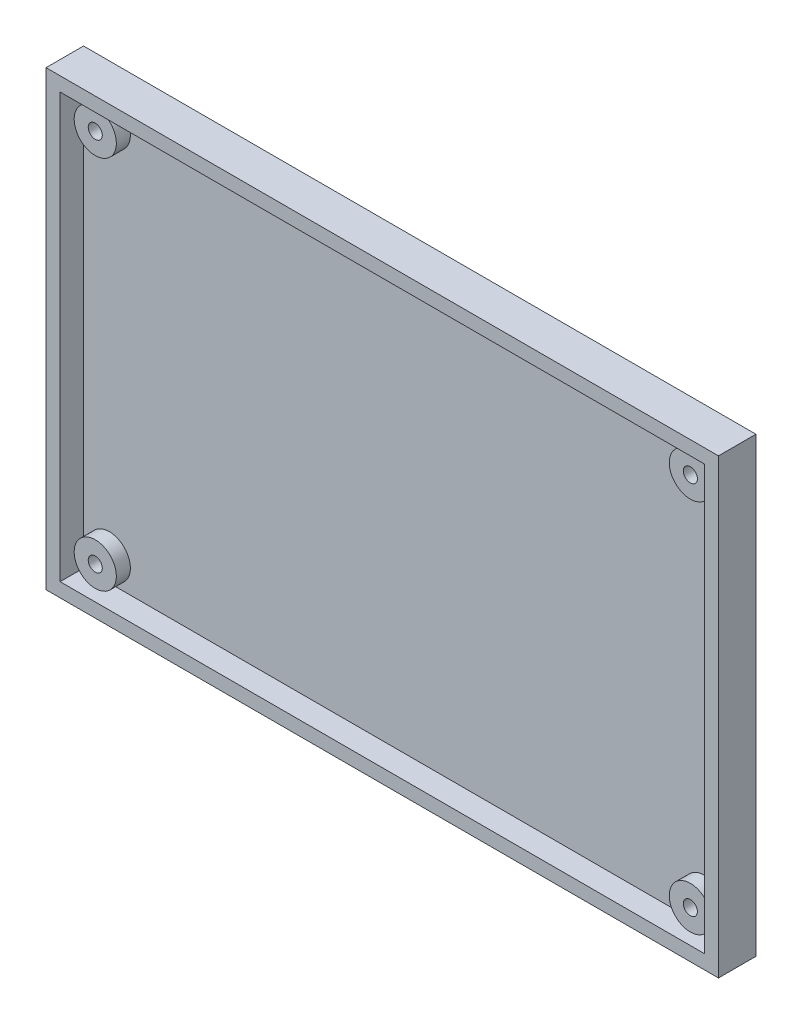
ISO-10303-21;
HEADER;
FILE_DESCRIPTION(('STEP AP214'),'2;1');
FILE_NAME('part.step','',(''),(''),'','','');
FILE_SCHEMA(('AUTOMOTIVE_DESIGN { 1 0 10303 214 1 1 1 1 }'));
ENDSEC;
DATA;
#1=APPLICATION_CONTEXT('core data for automotive mechanical design processes');
#2=APPLICATION_PROTOCOL_DEFINITION('international standard','automotive_design',2000,#1);
#3=PRODUCT_CONTEXT('',#1,'mechanical');
#4=PRODUCT('Part','Part','',(#3));
#5=PRODUCT_RELATED_PRODUCT_CATEGORY('part','',(#4));
#6=PRODUCT_DEFINITION_FORMATION('','',#4);
#7=PRODUCT_DEFINITION_CONTEXT('part definition',#1,'design');
#8=PRODUCT_DEFINITION('design','',#6,#7);
#9=PRODUCT_DEFINITION_SHAPE('','',#8);
#10=(LENGTH_UNIT() NAMED_UNIT(*) SI_UNIT(.MILLI.,.METRE.));
#11=(NAMED_UNIT(*) PLANE_ANGLE_UNIT() SI_UNIT($,.RADIAN.));
#12=(NAMED_UNIT(*) SI_UNIT($,.STERADIAN.) SOLID_ANGLE_UNIT());
#13=UNCERTAINTY_MEASURE_WITH_UNIT(LENGTH_MEASURE(1.E-05),#10,'distance_accuracy_value','');
#14=(GEOMETRIC_REPRESENTATION_CONTEXT(3) GLOBAL_UNCERTAINTY_ASSIGNED_CONTEXT((#13)) GLOBAL_UNIT_ASSIGNED_CONTEXT((#10,
#11,#12)) REPRESENTATION_CONTEXT('',''));
#15=CARTESIAN_POINT('',(0.,0.,0.));
#16=DIRECTION('',(0.,0.,1.));
#17=DIRECTION('',(1.,0.,0.));
#18=AXIS2_PLACEMENT_3D('',#15,#16,#17);
#19=CARTESIAN_POINT('',(0.,0.,8.));
#20=DIRECTION('',(0.,0.,-1.));
#21=DIRECTION('',(-1.,0.,0.));
#22=AXIS2_PLACEMENT_3D('',#19,#20,#21);
#23=PLANE('',#22);
#24=DIRECTION('',(0.,-1.,0.));
#25=VECTOR('',#24,1.);
#26=CARTESIAN_POINT('',(3.,0.,8.));
#27=LINE('',#26,#25);
#28=CARTESIAN_POINT('',(3.,93.5,8.));
#29=VERTEX_POINT('',#28);
#30=CARTESIAN_POINT('',(3.,3.,8.));
#31=VERTEX_POINT('',#30);
#32=EDGE_CURVE('E133',#29,#31,#27,.T.);
#33=ORIENTED_EDGE('',*,*,#32,.F.);
#34=DIRECTION('',(-1.,0.,0.));
#35=VECTOR('',#34,1.);
#36=CARTESIAN_POINT('',(0.,93.5,8.));
#37=LINE('',#36,#35);
#38=CARTESIAN_POINT('',(140.5,93.5,8.));
#39=VERTEX_POINT('',#38);
#40=EDGE_CURVE('E119',#39,#29,#37,.T.);
#41=ORIENTED_EDGE('',*,*,#40,.F.);
#42=DIRECTION('',(0.,1.,0.));
#43=VECTOR('',#42,1.);
#44=CARTESIAN_POINT('',(140.5,0.,8.));
#45=LINE('',#44,#43);
#46=CARTESIAN_POINT('',(140.5,3.,8.));
#47=VERTEX_POINT('',#46);
#48=EDGE_CURVE('E164',#47,#39,#45,.T.);
#49=ORIENTED_EDGE('',*,*,#48,.F.);
#50=DIRECTION('',(1.,0.,0.));
#51=VECTOR('',#50,1.);
#52=CARTESIAN_POINT('',(0.,3.,8.));
#53=LINE('',#52,#51);
#54=EDGE_CURVE('E162',#31,#47,#53,.T.);
#55=ORIENTED_EDGE('',*,*,#54,.F.);
#56=EDGE_LOOP('',(#33,#41,#49,#55));
#57=FACE_BOUND('',#56,.T.);
#58=DIRECTION('',(0.,-1.,0.));
#59=VECTOR('',#58,1.);
#60=CARTESIAN_POINT('',(0.,0.,8.));
#61=LINE('',#60,#59);
#62=CARTESIAN_POINT('',(0.,96.5,8.));
#63=VERTEX_POINT('',#62);
#64=CARTESIAN_POINT('',(0.,0.,8.));
#65=VERTEX_POINT('',#64);
#66=EDGE_CURVE('E179',#63,#65,#61,.T.);
#67=ORIENTED_EDGE('',*,*,#66,.T.);
#68=DIRECTION('',(1.,0.,0.));
#69=VECTOR('',#68,1.);
#70=CARTESIAN_POINT('',(0.,0.,8.));
#71=LINE('',#70,#69);
#72=CARTESIAN_POINT('',(143.5,0.,8.));
#73=VERTEX_POINT('',#72);
#74=EDGE_CURVE('E94',#65,#73,#71,.T.);
#75=ORIENTED_EDGE('',*,*,#74,.T.);
#76=DIRECTION('',(0.,1.,0.));
#77=VECTOR('',#76,1.);
#78=CARTESIAN_POINT('',(143.5,0.,8.));
#79=LINE('',#78,#77);
#80=CARTESIAN_POINT('',(143.5,96.5,8.));
#81=VERTEX_POINT('',#80);
#82=EDGE_CURVE('E182',#73,#81,#79,.T.);
#83=ORIENTED_EDGE('',*,*,#82,.T.);
#84=DIRECTION('',(-1.,0.,0.));
#85=VECTOR('',#84,1.);
#86=CARTESIAN_POINT('',(0.,96.5,8.));
#87=LINE('',#86,#85);
#88=EDGE_CURVE('E66',#81,#63,#87,.T.);
#89=ORIENTED_EDGE('',*,*,#88,.T.);
#90=EDGE_LOOP('',(#67,#75,#83,#89));
#91=FACE_BOUND('',#90,.T.);
#92=ADVANCED_FACE('F41',(#57,#91),#23,.F.);
#93=CARTESIAN_POINT('',(0.,0.,0.));
#94=DIRECTION('',(0.,0.,-1.));
#95=DIRECTION('',(-1.,0.,0.));
#96=AXIS2_PLACEMENT_3D('',#93,#94,#95);
#97=PLANE('',#96);
#98=CARTESIAN_POINT('',(135.5,8.,0.));
#99=DIRECTION('',(0.,0.,1.));
#100=DIRECTION('',(1.,0.,0.));
#101=AXIS2_PLACEMENT_3D('',#98,#99,#100);
#102=CIRCLE('',#101,1.5);
#103=CARTESIAN_POINT('',(137.,8.,0.));
#104=VERTEX_POINT('',#103);
#105=EDGE_CURVE('E169',#104,#104,#102,.T.);
#106=ORIENTED_EDGE('',*,*,#105,.T.);
#107=EDGE_LOOP('',(#106));
#108=FACE_BOUND('',#107,.T.);
#109=CARTESIAN_POINT('',(8.5,88.,0.));
#110=DIRECTION('',(0.,0.,1.));
#111=DIRECTION('',(1.,0.,0.));
#112=AXIS2_PLACEMENT_3D('',#109,#110,#111);
#113=CIRCLE('',#112,1.5);
#114=CARTESIAN_POINT('',(10.,88.,0.));
#115=VERTEX_POINT('',#114);
#116=EDGE_CURVE('E175',#115,#115,#113,.T.);
#117=ORIENTED_EDGE('',*,*,#116,.T.);
#118=EDGE_LOOP('',(#117));
#119=FACE_BOUND('',#118,.T.);
#120=DIRECTION('',(0.,-1.,0.));
#121=VECTOR('',#120,1.);
#122=CARTESIAN_POINT('',(0.,0.,0.));
#123=LINE('',#122,#121);
#124=CARTESIAN_POINT('',(0.,96.5,0.));
#125=VERTEX_POINT('',#124);
#126=CARTESIAN_POINT('',(0.,0.,0.));
#127=VERTEX_POINT('',#126);
#128=EDGE_CURVE('E178',#125,#127,#123,.T.);
#129=ORIENTED_EDGE('',*,*,#128,.F.);
#130=DIRECTION('',(-1.,0.,0.));
#131=VECTOR('',#130,1.);
#132=CARTESIAN_POINT('',(0.,96.5,0.));
#133=LINE('',#132,#131);
#134=CARTESIAN_POINT('',(143.5,96.5,0.));
#135=VERTEX_POINT('',#134);
#136=EDGE_CURVE('E87',#135,#125,#133,.T.);
#137=ORIENTED_EDGE('',*,*,#136,.F.);
#138=DIRECTION('',(0.,1.,0.));
#139=VECTOR('',#138,1.);
#140=CARTESIAN_POINT('',(143.5,0.,0.));
#141=LINE('',#140,#139);
#142=CARTESIAN_POINT('',(143.5,0.,0.));
#143=VERTEX_POINT('',#142);
#144=EDGE_CURVE('E190',#143,#135,#141,.T.);
#145=ORIENTED_EDGE('',*,*,#144,.F.);
#146=DIRECTION('',(1.,0.,0.));
#147=VECTOR('',#146,1.);
#148=CARTESIAN_POINT('',(0.,0.,0.));
#149=LINE('',#148,#147);
#150=EDGE_CURVE('E188',#127,#143,#149,.T.);
#151=ORIENTED_EDGE('',*,*,#150,.F.);
#152=EDGE_LOOP('',(#129,#137,#145,#151));
#153=FACE_BOUND('',#152,.T.);
#154=CARTESIAN_POINT('',(8.50000000000001,8.,0.));
#155=DIRECTION('',(0.,0.,1.));
#156=DIRECTION('',(1.,0.,0.));
#157=AXIS2_PLACEMENT_3D('',#154,#155,#156);
#158=CIRCLE('',#157,1.5);
#159=CARTESIAN_POINT('',(10.,8.,0.));
#160=VERTEX_POINT('',#159);
#161=EDGE_CURVE('E172',#160,#160,#158,.T.);
#162=ORIENTED_EDGE('',*,*,#161,.T.);
#163=EDGE_LOOP('',(#162));
#164=FACE_BOUND('',#163,.T.);
#165=CARTESIAN_POINT('',(135.5,88.,0.));
#166=DIRECTION('',(0.,0.,1.));
#167=DIRECTION('',(1.,0.,0.));
#168=AXIS2_PLACEMENT_3D('',#165,#166,#167);
#169=CIRCLE('',#168,1.5);
#170=CARTESIAN_POINT('',(137.,88.,0.));
#171=VERTEX_POINT('',#170);
#172=EDGE_CURVE('E156',#171,#171,#169,.T.);
#173=ORIENTED_EDGE('',*,*,#172,.T.);
#174=EDGE_LOOP('',(#173));
#175=FACE_BOUND('',#174,.T.);
#176=ADVANCED_FACE('F204',(#108,#119,#153,#164,#175),#97,.T.);
#177=CARTESIAN_POINT('',(0.,0.,8.));
#178=DIRECTION('',(1.,0.,0.));
#179=DIRECTION('',(0.,0.,-1.));
#180=AXIS2_PLACEMENT_3D('',#177,#178,#179);
#181=PLANE('',#180);
#182=ORIENTED_EDGE('',*,*,#128,.T.);
#183=DIRECTION('',(0.,0.,-1.));
#184=VECTOR('',#183,1.);
#185=CARTESIAN_POINT('',(0.,0.,8.));
#186=LINE('',#185,#184);
#187=EDGE_CURVE('E11',#65,#127,#186,.T.);
#188=ORIENTED_EDGE('',*,*,#187,.F.);
#189=ORIENTED_EDGE('',*,*,#66,.F.);
#190=DIRECTION('',(0.,0.,-1.));
#191=VECTOR('',#190,1.);
#192=CARTESIAN_POINT('',(0.,96.5,8.));
#193=LINE('',#192,#191);
#194=EDGE_CURVE('E185',#63,#125,#193,.T.);
#195=ORIENTED_EDGE('',*,*,#194,.T.);
#196=EDGE_LOOP('',(#182,#188,#189,#195));
#197=FACE_BOUND('',#196,.T.);
#198=ADVANCED_FACE('F43',(#197),#181,.F.);
#199=CARTESIAN_POINT('',(0.,0.,8.));
#200=DIRECTION('',(0.,1.,0.));
#201=DIRECTION('',(0.,0.,1.));
#202=AXIS2_PLACEMENT_3D('',#199,#200,#201);
#203=PLANE('',#202);
#204=ORIENTED_EDGE('',*,*,#150,.T.);
#205=DIRECTION('',(0.,0.,-1.));
#206=VECTOR('',#205,1.);
#207=CARTESIAN_POINT('',(143.5,0.,8.));
#208=LINE('',#207,#206);
#209=EDGE_CURVE('E50',#73,#143,#208,.T.);
#210=ORIENTED_EDGE('',*,*,#209,.F.);
#211=ORIENTED_EDGE('',*,*,#74,.F.);
#212=ORIENTED_EDGE('',*,*,#187,.T.);
#213=EDGE_LOOP('',(#204,#210,#211,#212));
#214=FACE_BOUND('',#213,.T.);
#215=ADVANCED_FACE('F221',(#214),#203,.F.);
#216=CARTESIAN_POINT('',(143.5,0.,8.));
#217=DIRECTION('',(-1.,0.,0.));
#218=DIRECTION('',(0.,0.,1.));
#219=AXIS2_PLACEMENT_3D('',#216,#217,#218);
#220=PLANE('',#219);
#221=ORIENTED_EDGE('',*,*,#144,.T.);
#222=DIRECTION('',(0.,0.,-1.));
#223=VECTOR('',#222,1.);
#224=CARTESIAN_POINT('',(143.5,96.5,8.));
#225=LINE('',#224,#223);
#226=EDGE_CURVE('E194',#81,#135,#225,.T.);
#227=ORIENTED_EDGE('',*,*,#226,.F.);
#228=ORIENTED_EDGE('',*,*,#82,.F.);
#229=ORIENTED_EDGE('',*,*,#209,.T.);
#230=EDGE_LOOP('',(#221,#227,#228,#229));
#231=FACE_BOUND('',#230,.T.);
#232=ADVANCED_FACE('F200',(#231),#220,.F.);
#233=CARTESIAN_POINT('',(0.,96.5,8.));
#234=DIRECTION('',(0.,-1.,0.));
#235=DIRECTION('',(0.,0.,-1.));
#236=AXIS2_PLACEMENT_3D('',#233,#234,#235);
#237=PLANE('',#236);
#238=ORIENTED_EDGE('',*,*,#136,.T.);
#239=ORIENTED_EDGE('',*,*,#194,.F.);
#240=ORIENTED_EDGE('',*,*,#88,.F.);
#241=ORIENTED_EDGE('',*,*,#226,.T.);
#242=EDGE_LOOP('',(#238,#239,#240,#241));
#243=FACE_BOUND('',#242,.T.);
#244=ADVANCED_FACE('F209',(#243),#237,.F.);
#245=CARTESIAN_POINT('',(8.5,88.,8.));
#246=DIRECTION('',(0.,0.,-1.));
#247=DIRECTION('',(-1.,0.,0.));
#248=AXIS2_PLACEMENT_3D('',#245,#246,#247);
#249=CYLINDRICAL_SURFACE('',#248,1.5);
#250=CARTESIAN_POINT('',(8.5,88.,6.));
#251=DIRECTION('',(0.,0.,-1.));
#252=DIRECTION('',(-1.,0.,0.));
#253=AXIS2_PLACEMENT_3D('',#250,#251,#252);
#254=CIRCLE('',#253,1.5);
#255=CARTESIAN_POINT('',(7.,88.,6.));
#256=VERTEX_POINT('',#255);
#257=EDGE_CURVE('E155',#256,#256,#254,.T.);
#258=ORIENTED_EDGE('',*,*,#257,.F.);
#259=EDGE_LOOP('',(#258));
#260=FACE_BOUND('',#259,.T.);
#261=ORIENTED_EDGE('',*,*,#116,.F.);
#262=EDGE_LOOP('',(#261));
#263=FACE_BOUND('',#262,.T.);
#264=ADVANCED_FACE('F211',(#260,#263),#249,.F.);
#265=CARTESIAN_POINT('',(8.50000000000001,8.,8.));
#266=DIRECTION('',(0.,0.,-1.));
#267=DIRECTION('',(-1.,0.,0.));
#268=AXIS2_PLACEMENT_3D('',#265,#266,#267);
#269=CYLINDRICAL_SURFACE('',#268,1.5);
#270=CARTESIAN_POINT('',(8.50000000000001,8.,6.));
#271=DIRECTION('',(0.,0.,-1.));
#272=DIRECTION('',(-1.,0.,0.));
#273=AXIS2_PLACEMENT_3D('',#270,#271,#272);
#274=CIRCLE('',#273,1.5);
#275=CARTESIAN_POINT('',(7.00000000000001,8.,6.));
#276=VERTEX_POINT('',#275);
#277=EDGE_CURVE('E312',#276,#276,#274,.T.);
#278=ORIENTED_EDGE('',*,*,#277,.F.);
#279=EDGE_LOOP('',(#278));
#280=FACE_BOUND('',#279,.T.);
#281=ORIENTED_EDGE('',*,*,#161,.F.);
#282=EDGE_LOOP('',(#281));
#283=FACE_BOUND('',#282,.T.);
#284=ADVANCED_FACE('F218',(#280,#283),#269,.F.);
#285=CARTESIAN_POINT('',(135.5,8.,8.));
#286=DIRECTION('',(0.,0.,-1.));
#287=DIRECTION('',(-1.,0.,0.));
#288=AXIS2_PLACEMENT_3D('',#285,#286,#287);
#289=CYLINDRICAL_SURFACE('',#288,1.5);
#290=CARTESIAN_POINT('',(135.5,8.,6.));
#291=DIRECTION('',(0.,0.,-1.));
#292=DIRECTION('',(-1.,0.,0.));
#293=AXIS2_PLACEMENT_3D('',#290,#291,#292);
#294=CIRCLE('',#293,1.5);
#295=CARTESIAN_POINT('',(134.,8.,6.));
#296=VERTEX_POINT('',#295);
#297=EDGE_CURVE('E309',#296,#296,#294,.T.);
#298=ORIENTED_EDGE('',*,*,#297,.F.);
#299=EDGE_LOOP('',(#298));
#300=FACE_BOUND('',#299,.T.);
#301=ORIENTED_EDGE('',*,*,#105,.F.);
#302=EDGE_LOOP('',(#301));
#303=FACE_BOUND('',#302,.T.);
#304=ADVANCED_FACE('F234',(#300,#303),#289,.F.);
#305=CARTESIAN_POINT('',(135.5,88.,8.));
#306=DIRECTION('',(0.,0.,-1.));
#307=DIRECTION('',(-1.,0.,0.));
#308=AXIS2_PLACEMENT_3D('',#305,#306,#307);
#309=CYLINDRICAL_SURFACE('',#308,1.5);
#310=CARTESIAN_POINT('',(135.5,88.,6.));
#311=DIRECTION('',(0.,0.,-1.));
#312=DIRECTION('',(-1.,0.,0.));
#313=AXIS2_PLACEMENT_3D('',#310,#311,#312);
#314=CIRCLE('',#313,1.5);
#315=CARTESIAN_POINT('',(134.,88.,6.));
#316=VERTEX_POINT('',#315);
#317=EDGE_CURVE('E294',#316,#316,#314,.T.);
#318=ORIENTED_EDGE('',*,*,#317,.F.);
#319=EDGE_LOOP('',(#318));
#320=FACE_BOUND('',#319,.T.);
#321=ORIENTED_EDGE('',*,*,#172,.F.);
#322=EDGE_LOOP('',(#321));
#323=FACE_BOUND('',#322,.T.);
#324=ADVANCED_FACE('F238',(#320,#323),#309,.F.);
#325=CARTESIAN_POINT('',(0.,0.,3.));
#326=DIRECTION('',(0.,0.,-1.));
#327=DIRECTION('',(-1.,0.,0.));
#328=AXIS2_PLACEMENT_3D('',#325,#326,#327);
#329=PLANE('',#328);
#330=CARTESIAN_POINT('',(135.5,8.,3.));
#331=DIRECTION('',(0.,0.,-1.));
#332=DIRECTION('',(-1.,0.,0.));
#333=AXIS2_PLACEMENT_3D('',#330,#331,#332);
#334=CIRCLE('',#333,4.5);
#335=CARTESIAN_POINT('',(131.,8.,3.));
#336=VERTEX_POINT('',#335);
#337=EDGE_CURVE('E151',#336,#336,#334,.F.);
#338=ORIENTED_EDGE('',*,*,#337,.F.);
#339=EDGE_LOOP('',(#338));
#340=FACE_BOUND('',#339,.T.);
#341=CARTESIAN_POINT('',(8.5,88.,3.));
#342=DIRECTION('',(0.,0.,-1.));
#343=DIRECTION('',(-1.,0.,0.));
#344=AXIS2_PLACEMENT_3D('',#341,#342,#343);
#345=CIRCLE('',#344,4.5);
#346=CARTESIAN_POINT('',(4.,88.,3.));
#347=VERTEX_POINT('',#346);
#348=EDGE_CURVE('E140',#347,#347,#345,.F.);
#349=ORIENTED_EDGE('',*,*,#348,.F.);
#350=EDGE_LOOP('',(#349));
#351=FACE_BOUND('',#350,.T.);
#352=DIRECTION('',(0.,-1.,0.));
#353=VECTOR('',#352,1.);
#354=CARTESIAN_POINT('',(3.,0.,3.));
#355=LINE('',#354,#353);
#356=CARTESIAN_POINT('',(3.,93.5,3.));
#357=VERTEX_POINT('',#356);
#358=CARTESIAN_POINT('',(3.,3.,3.));
#359=VERTEX_POINT('',#358);
#360=EDGE_CURVE('E130',#357,#359,#355,.T.);
#361=ORIENTED_EDGE('',*,*,#360,.T.);
#362=DIRECTION('',(1.,0.,0.));
#363=VECTOR('',#362,1.);
#364=CARTESIAN_POINT('',(0.,3.,3.));
#365=LINE('',#364,#363);
#366=CARTESIAN_POINT('',(140.5,3.,3.));
#367=VERTEX_POINT('',#366);
#368=EDGE_CURVE('E139',#359,#367,#365,.T.);
#369=ORIENTED_EDGE('',*,*,#368,.T.);
#370=DIRECTION('',(0.,1.,0.));
#371=VECTOR('',#370,1.);
#372=CARTESIAN_POINT('',(140.5,0.,3.));
#373=LINE('',#372,#371);
#374=CARTESIAN_POINT('',(140.5,93.5,3.));
#375=VERTEX_POINT('',#374);
#376=EDGE_CURVE('E132',#367,#375,#373,.T.);
#377=ORIENTED_EDGE('',*,*,#376,.T.);
#378=DIRECTION('',(-1.,0.,0.));
#379=VECTOR('',#378,1.);
#380=CARTESIAN_POINT('',(0.,93.5,3.));
#381=LINE('',#380,#379);
#382=EDGE_CURVE('E117',#375,#357,#381,.T.);
#383=ORIENTED_EDGE('',*,*,#382,.T.);
#384=EDGE_LOOP('',(#361,#369,#377,#383));
#385=FACE_BOUND('',#384,.T.);
#386=CARTESIAN_POINT('',(8.50000000000001,8.,3.));
#387=DIRECTION('',(0.,0.,-1.));
#388=DIRECTION('',(-1.,0.,0.));
#389=AXIS2_PLACEMENT_3D('',#386,#387,#388);
#390=CIRCLE('',#389,4.5);
#391=CARTESIAN_POINT('',(4.00000000000001,8.,3.));
#392=VERTEX_POINT('',#391);
#393=EDGE_CURVE('E144',#392,#392,#390,.F.);
#394=ORIENTED_EDGE('',*,*,#393,.F.);
#395=EDGE_LOOP('',(#394));
#396=FACE_BOUND('',#395,.T.);
#397=CARTESIAN_POINT('',(135.5,88.,3.));
#398=DIRECTION('',(0.,0.,-1.));
#399=DIRECTION('',(-1.,0.,0.));
#400=AXIS2_PLACEMENT_3D('',#397,#398,#399);
#401=CIRCLE('',#400,4.5);
#402=CARTESIAN_POINT('',(131.,88.,3.));
#403=VERTEX_POINT('',#402);
#404=EDGE_CURVE('E152',#403,#403,#401,.F.);
#405=ORIENTED_EDGE('',*,*,#404,.F.);
#406=EDGE_LOOP('',(#405));
#407=FACE_BOUND('',#406,.T.);
#408=ADVANCED_FACE('F127',(#340,#351,#385,#396,#407),#329,.F.);
#409=CARTESIAN_POINT('',(3.,0.,8.));
#410=DIRECTION('',(1.,0.,0.));
#411=DIRECTION('',(0.,0.,-1.));
#412=AXIS2_PLACEMENT_3D('',#409,#410,#411);
#413=PLANE('',#412);
#414=ORIENTED_EDGE('',*,*,#360,.F.);
#415=DIRECTION('',(0.,0.,-1.));
#416=VECTOR('',#415,1.);
#417=CARTESIAN_POINT('',(3.,93.5,8.));
#418=LINE('',#417,#416);
#419=EDGE_CURVE('E114',#29,#357,#418,.T.);
#420=ORIENTED_EDGE('',*,*,#419,.F.);
#421=ORIENTED_EDGE('',*,*,#32,.T.);
#422=DIRECTION('',(0.,0.,-1.));
#423=VECTOR('',#422,1.);
#424=CARTESIAN_POINT('',(3.,3.,8.));
#425=LINE('',#424,#423);
#426=EDGE_CURVE('E137',#31,#359,#425,.T.);
#427=ORIENTED_EDGE('',*,*,#426,.T.);
#428=EDGE_LOOP('',(#414,#420,#421,#427));
#429=FACE_BOUND('',#428,.T.);
#430=ADVANCED_FACE('F135',(#429),#413,.T.);
#431=CARTESIAN_POINT('',(0.,3.,8.));
#432=DIRECTION('',(0.,1.,0.));
#433=DIRECTION('',(0.,0.,1.));
#434=AXIS2_PLACEMENT_3D('',#431,#432,#433);
#435=PLANE('',#434);
#436=ORIENTED_EDGE('',*,*,#368,.F.);
#437=ORIENTED_EDGE('',*,*,#426,.F.);
#438=ORIENTED_EDGE('',*,*,#54,.T.);
#439=DIRECTION('',(0.,0.,-1.));
#440=VECTOR('',#439,1.);
#441=CARTESIAN_POINT('',(140.5,3.,8.));
#442=LINE('',#441,#440);
#443=EDGE_CURVE('E157',#47,#367,#442,.T.);
#444=ORIENTED_EDGE('',*,*,#443,.T.);
#445=EDGE_LOOP('',(#436,#437,#438,#444));
#446=FACE_BOUND('',#445,.T.);
#447=ADVANCED_FACE('F265',(#446),#435,.T.);
#448=CARTESIAN_POINT('',(140.5,0.,8.));
#449=DIRECTION('',(-1.,0.,0.));
#450=DIRECTION('',(0.,0.,1.));
#451=AXIS2_PLACEMENT_3D('',#448,#449,#450);
#452=PLANE('',#451);
#453=ORIENTED_EDGE('',*,*,#376,.F.);
#454=ORIENTED_EDGE('',*,*,#443,.F.);
#455=ORIENTED_EDGE('',*,*,#48,.T.);
#456=DIRECTION('',(0.,0.,-1.));
#457=VECTOR('',#456,1.);
#458=CARTESIAN_POINT('',(140.5,93.5,8.));
#459=LINE('',#458,#457);
#460=EDGE_CURVE('E57',#39,#375,#459,.T.);
#461=ORIENTED_EDGE('',*,*,#460,.T.);
#462=EDGE_LOOP('',(#453,#454,#455,#461));
#463=FACE_BOUND('',#462,.T.);
#464=ADVANCED_FACE('F262',(#463),#452,.T.);
#465=CARTESIAN_POINT('',(0.,93.5,8.));
#466=DIRECTION('',(0.,-1.,0.));
#467=DIRECTION('',(0.,0.,-1.));
#468=AXIS2_PLACEMENT_3D('',#465,#466,#467);
#469=PLANE('',#468);
#470=ORIENTED_EDGE('',*,*,#382,.F.);
#471=ORIENTED_EDGE('',*,*,#460,.F.);
#472=ORIENTED_EDGE('',*,*,#40,.T.);
#473=ORIENTED_EDGE('',*,*,#419,.T.);
#474=EDGE_LOOP('',(#470,#471,#472,#473));
#475=FACE_BOUND('',#474,.T.);
#476=ADVANCED_FACE('F116',(#475),#469,.T.);
#477=CARTESIAN_POINT('',(8.5,88.,8.));
#478=DIRECTION('',(0.,0.,-1.));
#479=DIRECTION('',(-1.,0.,0.));
#480=AXIS2_PLACEMENT_3D('',#477,#478,#479);
#481=CYLINDRICAL_SURFACE('',#480,4.5);
#482=CARTESIAN_POINT('',(8.5,88.,6.));
#483=DIRECTION('',(0.,0.,-1.));
#484=DIRECTION('',(-1.,0.,0.));
#485=AXIS2_PLACEMENT_3D('',#482,#483,#484);
#486=CIRCLE('',#485,4.5);
#487=CARTESIAN_POINT('',(4.,88.,6.));
#488=VERTEX_POINT('',#487);
#489=EDGE_CURVE('E303',#488,#488,#486,.T.);
#490=ORIENTED_EDGE('',*,*,#489,.T.);
#491=EDGE_LOOP('',(#490));
#492=FACE_BOUND('',#491,.T.);
#493=ORIENTED_EDGE('',*,*,#348,.T.);
#494=EDGE_LOOP('',(#493));
#495=FACE_BOUND('',#494,.T.);
#496=ADVANCED_FACE('F255',(#492,#495),#481,.T.);
#497=CARTESIAN_POINT('',(8.50000000000001,8.,8.));
#498=DIRECTION('',(0.,0.,-1.));
#499=DIRECTION('',(-1.,0.,0.));
#500=AXIS2_PLACEMENT_3D('',#497,#498,#499);
#501=CYLINDRICAL_SURFACE('',#500,4.5);
#502=CARTESIAN_POINT('',(8.50000000000001,8.,6.));
#503=DIRECTION('',(0.,0.,-1.));
#504=DIRECTION('',(-1.,0.,0.));
#505=AXIS2_PLACEMENT_3D('',#502,#503,#504);
#506=CIRCLE('',#505,4.5);
#507=CARTESIAN_POINT('',(4.00000000000001,8.,6.));
#508=VERTEX_POINT('',#507);
#509=EDGE_CURVE('E299',#508,#508,#506,.T.);
#510=ORIENTED_EDGE('',*,*,#509,.T.);
#511=EDGE_LOOP('',(#510));
#512=FACE_BOUND('',#511,.T.);
#513=ORIENTED_EDGE('',*,*,#393,.T.);
#514=EDGE_LOOP('',(#513));
#515=FACE_BOUND('',#514,.T.);
#516=ADVANCED_FACE('F251',(#512,#515),#501,.T.);
#517=CARTESIAN_POINT('',(135.5,8.,8.));
#518=DIRECTION('',(0.,0.,-1.));
#519=DIRECTION('',(-1.,0.,0.));
#520=AXIS2_PLACEMENT_3D('',#517,#518,#519);
#521=CYLINDRICAL_SURFACE('',#520,4.5);
#522=CARTESIAN_POINT('',(135.5,8.,6.));
#523=DIRECTION('',(0.,0.,-1.));
#524=DIRECTION('',(-1.,0.,0.));
#525=AXIS2_PLACEMENT_3D('',#522,#523,#524);
#526=CIRCLE('',#525,4.5);
#527=CARTESIAN_POINT('',(131.,8.,6.));
#528=VERTEX_POINT('',#527);
#529=EDGE_CURVE('E297',#528,#528,#526,.T.);
#530=ORIENTED_EDGE('',*,*,#529,.T.);
#531=EDGE_LOOP('',(#530));
#532=FACE_BOUND('',#531,.T.);
#533=ORIENTED_EDGE('',*,*,#337,.T.);
#534=EDGE_LOOP('',(#533));
#535=FACE_BOUND('',#534,.T.);
#536=ADVANCED_FACE('F247',(#532,#535),#521,.T.);
#537=CARTESIAN_POINT('',(135.5,88.,8.));
#538=DIRECTION('',(0.,0.,-1.));
#539=DIRECTION('',(-1.,0.,0.));
#540=AXIS2_PLACEMENT_3D('',#537,#538,#539);
#541=CYLINDRICAL_SURFACE('',#540,4.5);
#542=CARTESIAN_POINT('',(135.5,88.,6.));
#543=DIRECTION('',(0.,0.,-1.));
#544=DIRECTION('',(-1.,0.,0.));
#545=AXIS2_PLACEMENT_3D('',#542,#543,#544);
#546=CIRCLE('',#545,4.5);
#547=CARTESIAN_POINT('',(131.,88.,6.));
#548=VERTEX_POINT('',#547);
#549=EDGE_CURVE('E45',#548,#548,#546,.T.);
#550=ORIENTED_EDGE('',*,*,#549,.T.);
#551=EDGE_LOOP('',(#550));
#552=FACE_BOUND('',#551,.T.);
#553=ORIENTED_EDGE('',*,*,#404,.T.);
#554=EDGE_LOOP('',(#553));
#555=FACE_BOUND('',#554,.T.);
#556=ADVANCED_FACE('F243',(#552,#555),#541,.T.);
#557=CARTESIAN_POINT('',(0.,0.,6.));
#558=DIRECTION('',(0.,0.,-1.));
#559=DIRECTION('',(-1.,0.,0.));
#560=AXIS2_PLACEMENT_3D('',#557,#558,#559);
#561=PLANE('',#560);
#562=ORIENTED_EDGE('',*,*,#317,.T.);
#563=EDGE_LOOP('',(#562));
#564=FACE_BOUND('',#563,.T.);
#565=ORIENTED_EDGE('',*,*,#549,.F.);
#566=EDGE_LOOP('',(#565));
#567=FACE_BOUND('',#566,.T.);
#568=ADVANCED_FACE('F246',(#564,#567),#561,.F.);
#569=ORIENTED_EDGE('',*,*,#297,.T.);
#570=EDGE_LOOP('',(#569));
#571=FACE_BOUND('',#570,.T.);
#572=ORIENTED_EDGE('',*,*,#529,.F.);
#573=EDGE_LOOP('',(#572));
#574=FACE_BOUND('',#573,.T.);
#575=ADVANCED_FACE('F281',(#571,#574),#561,.F.);
#576=ORIENTED_EDGE('',*,*,#277,.T.);
#577=EDGE_LOOP('',(#576));
#578=FACE_BOUND('',#577,.T.);
#579=ORIENTED_EDGE('',*,*,#509,.F.);
#580=EDGE_LOOP('',(#579));
#581=FACE_BOUND('',#580,.T.);
#582=ADVANCED_FACE('F276',(#578,#581),#561,.F.);
#583=ORIENTED_EDGE('',*,*,#257,.T.);
#584=EDGE_LOOP('',(#583));
#585=FACE_BOUND('',#584,.T.);
#586=ORIENTED_EDGE('',*,*,#489,.F.);
#587=EDGE_LOOP('',(#586));
#588=FACE_BOUND('',#587,.T.);
#589=ADVANCED_FACE('F274',(#585,#588),#561,.F.);
#590=CLOSED_SHELL('',(#92,#176,#198,#215,#232,#244,#264,#284,#304,#324,#408,#430,#447,#464,#476,
#496,#516,#536,#556,#568,#575,#582,#589));
#591=MANIFOLD_SOLID_BREP('B2',#590);
#592=ADVANCED_BREP_SHAPE_REPRESENTATION('',(#18,#591),#14);
#593=SHAPE_DEFINITION_REPRESENTATION(#9,#592);
ENDSEC;
END-ISO-10303-21;
